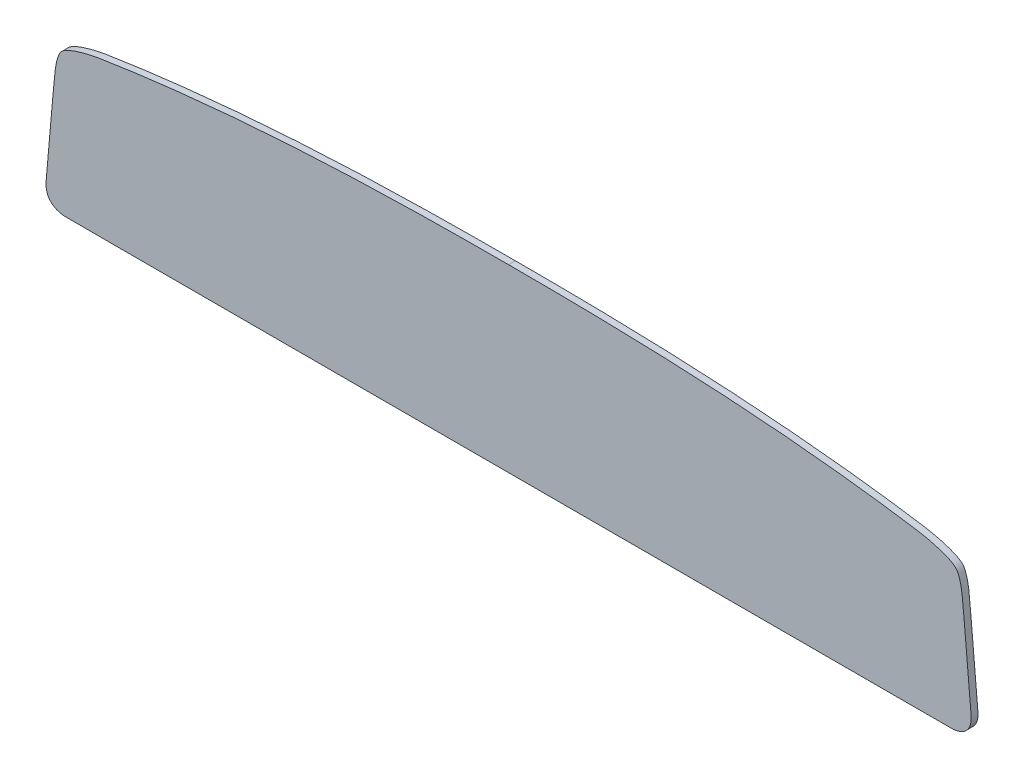
ISO-10303-21;
HEADER;
FILE_DESCRIPTION(('STEP AP214'),'2;1');
FILE_NAME('part.step','',(''),(''),'','','');
FILE_SCHEMA(('AUTOMOTIVE_DESIGN { 1 0 10303 214 1 1 1 1 }'));
ENDSEC;
DATA;
#1=APPLICATION_CONTEXT('core data for automotive mechanical design processes');
#2=APPLICATION_PROTOCOL_DEFINITION('international standard','automotive_design',2000,#1);
#3=PRODUCT_CONTEXT('',#1,'mechanical');
#4=PRODUCT('Part','Part','',(#3));
#5=PRODUCT_RELATED_PRODUCT_CATEGORY('part','',(#4));
#6=PRODUCT_DEFINITION_FORMATION('','',#4);
#7=PRODUCT_DEFINITION_CONTEXT('part definition',#1,'design');
#8=PRODUCT_DEFINITION('design','',#6,#7);
#9=PRODUCT_DEFINITION_SHAPE('','',#8);
#10=(LENGTH_UNIT() NAMED_UNIT(*) SI_UNIT(.MILLI.,.METRE.));
#11=(NAMED_UNIT(*) PLANE_ANGLE_UNIT() SI_UNIT($,.RADIAN.));
#12=(NAMED_UNIT(*) SI_UNIT($,.STERADIAN.) SOLID_ANGLE_UNIT());
#13=UNCERTAINTY_MEASURE_WITH_UNIT(LENGTH_MEASURE(1.E-05),#10,'distance_accuracy_value','');
#14=(GEOMETRIC_REPRESENTATION_CONTEXT(3) GLOBAL_UNCERTAINTY_ASSIGNED_CONTEXT((#13)) GLOBAL_UNIT_ASSIGNED_CONTEXT((#10,
#11,#12)) REPRESENTATION_CONTEXT('',''));
#15=CARTESIAN_POINT('',(0.,0.,0.));
#16=DIRECTION('',(0.,0.,1.));
#17=DIRECTION('',(1.,0.,0.));
#18=AXIS2_PLACEMENT_3D('',#15,#16,#17);
#19=CARTESIAN_POINT('',(0.,0.,10.3));
#20=DIRECTION('',(0.,0.,-1.));
#21=DIRECTION('',(-1.,0.,0.));
#22=AXIS2_PLACEMENT_3D('',#19,#20,#21);
#23=PLANE('',#22);
#24=CARTESIAN_POINT('',(-47.56912982624,0.326187795267278,10.3));
#25=CARTESIAN_POINT('',(-42.9675171023301,0.326187794812386,10.3));
#26=CARTESIAN_POINT('',(-36.0650978624594,0.3261879496746,10.3));
#27=CARTESIAN_POINT('',(-26.86187278429,0.3261875339793,10.3));
#28=CARTESIAN_POINT('',(-19.95945259593,0.3261887776534,10.3));
#29=CARTESIAN_POINT('',(-13.05703736517,0.3261841106344,10.3));
#30=CARTESIAN_POINT('',(-7.305010043133,0.3261986275571,10.3));
#31=CARTESIAN_POINT('',(-2.703419137806,0.3261690217879,10.3));
#32=CARTESIAN_POINT('',(0.1726374060877,0.3262443633776,10.3));
#33=CARTESIAN_POINT('',(2.473359002549,0.3260897128358,10.3));
#34=CARTESIAN_POINT('',(4.199135360457,0.3265621865685,10.3));
#35=CARTESIAN_POINT('',(5.636863057216,0.3250838962957,10.3));
#36=CARTESIAN_POINT('',(6.787248071171,0.3280996169696,10.3));
#37=CARTESIAN_POINT('',(7.463255217358,0.3209091780522,10.3));
#38=CARTESIAN_POINT('',(7.935416276697,0.3321241949565,10.3));
#39=CARTESIAN_POINT('',(8.212603998683,0.3633713733795,10.3));
#40=CARTESIAN_POINT('',(8.480052641929,0.4145581269059,10.3));
#41=CARTESIAN_POINT('',(8.729897320077,0.4857691221672,10.3));
#42=CARTESIAN_POINT('',(8.957801185256,0.5738717609444,10.3));
#43=CARTESIAN_POINT('',(9.224669903279,0.7072943620178,10.3));
#44=CARTESIAN_POINT('',(9.511257379615,0.906871851562,10.3));
#45=CARTESIAN_POINT('',(9.792086577824,1.204703354788,10.3));
#46=CARTESIAN_POINT('',(10.00836818754,1.559738126784,10.3));
#47=CARTESIAN_POINT('',(10.13182534579,1.905481822193,10.3));
#48=CARTESIAN_POINT('',(10.1951387356,2.210820467913,10.3));
#49=CARTESIAN_POINT('',(10.22309993046,2.459009113422,10.3));
#50=CARTESIAN_POINT('',(10.23107979456,2.713348619511,10.3));
#51=CARTESIAN_POINT('',(10.20742265749,3.098072775931,10.3));
#52=CARTESIAN_POINT('',(10.15596601473,3.621499994136,10.3));
#53=CARTESIAN_POINT('',(10.08249767637,4.487595546331,10.3));
#54=CARTESIAN_POINT('',(9.986751761239,5.56898525624,10.3));
#55=CARTESIAN_POINT('',(9.873532141202,6.867543757359,10.3));
#56=CARTESIAN_POINT('',(9.72182230868,8.598628142754,10.3));
#57=CARTESIAN_POINT('',(9.533681804831,10.76204756605,10.3));
#58=CARTESIAN_POINT('',(9.318242371288,13.17702275878,10.3));
#59=CARTESIAN_POINT('',(9.147275044242,15.26271276746,10.3));
#60=CARTESIAN_POINT('',(8.913444416757,16.66497356985,10.3));
#61=CARTESIAN_POINT('',(8.622934671494,17.47437248034,10.3));
#62=CARTESIAN_POINT('',(8.425301401111,17.84077184074,10.3));
#63=CARTESIAN_POINT('',(8.153699328102,18.10191669933,10.3));
#64=CARTESIAN_POINT('',(7.568204093403,18.49251158866,10.3));
#65=CARTESIAN_POINT('',(6.517945120839,18.89642972097,10.3));
#66=CARTESIAN_POINT('',(5.089092954338,19.30326698634,10.3));
#67=CARTESIAN_POINT('',(3.546154795837,19.61225958704,10.3));
#68=CARTESIAN_POINT('',(2.015957887505,19.84329222974,10.3));
#69=CARTESIAN_POINT('',(0.5532858331606,20.05314931454,10.3));
#70=CARTESIAN_POINT('',(-1.21518351073,20.2957101885,10.3));
#71=CARTESIAN_POINT('',(-2.909966123613,20.51413042768,10.3));
#72=CARTESIAN_POINT('',(-4.593822822222,20.71786882672,10.3));
#73=CARTESIAN_POINT('',(-5.919036057207,20.87126456612,10.3));
#74=CARTESIAN_POINT('',(-7.084558967214,20.99978161406,10.3));
#75=CARTESIAN_POINT('',(-8.084433697253,21.10574294895,10.3));
#76=CARTESIAN_POINT('',(-9.027071276399,21.20275617258,10.3));
#77=CARTESIAN_POINT('',(-10.19211410662,21.31807381719,10.3));
#78=CARTESIAN_POINT('',(-12.17220834892,21.50413701163,10.3));
#79=CARTESIAN_POINT('',(-14.90410813764,21.7375141162,10.3));
#80=CARTESIAN_POINT('',(-17.73956288004,21.94663775683,10.3));
#81=CARTESIAN_POINT('',(-20.047551304,22.09711386552,10.3));
#82=CARTESIAN_POINT('',(-21.71706705891,22.19693073835,10.3));
#83=CARTESIAN_POINT('',(-23.33812624813,22.28570521937,10.3));
#84=CARTESIAN_POINT('',(-25.46870124897,22.39223216237,10.3));
#85=CARTESIAN_POINT('',(-28.14695342634,22.50748327014,10.3));
#86=CARTESIAN_POINT('',(-31.38256714397,22.61812830096,10.3));
#87=CARTESIAN_POINT('',(-34.6148391263,22.70228395682,10.3));
#88=CARTESIAN_POINT('',(-37.84757844213,22.76302595806,10.3));
#89=CARTESIAN_POINT('',(-42.1577463893385,22.81643989411,10.3));
#90=CARTESIAN_POINT('',(-45.4026489557668,22.829299999934,10.3));
#91=CARTESIAN_POINT('',(-47.56912982624,22.8293000000036,10.3));
#92=(BOUNDED_CURVE() B_SPLINE_CURVE(3,(#24,#25,#26,#27,#28,#29,#30,#31,#32,#33,#34,#35,#36,#37,
#38,#39,#40,#41,#42,#43,#44,#45,#46,#47,#48,#49,#50,#51,#52,#53,#54,#55,#56,#57,#58,#59,#60,#61,
#62,#63,#64,#65,#66,#67,#68,#69,#70,#71,#72,#73,#74,#75,#76,#77,#78,#79,#80,#81,#82,#83,#84,#85,
#86,#87,#88,#89,#90,#91),.UNSPECIFIED.,.F.,.F.) B_SPLINE_CURVE_WITH_KNOTS((4,1,1,1,1,1,1,1,1,1,
1,1,1,1,1,1,1,1,1,1,1,1,1,1,1,1,1,1,1,1,1,1,1,1,1,1,1,1,1,1,1,1,1,1,1,1,1,1,1,1,1,1,1,1,1,1,1,1,
1,1,1,1,1,1,1,4),(0.009781740553698,0.11284573127,0.1643777267269,0.2159097221838,
0.2674417176408,0.3189737130977,0.3447397108261,0.3705057085546,0.3833887074188,0.3962717062831,
0.4091547051473,0.4155962045794,0.4220377040115,0.4242349708695,0.4263684734723,0.4284871168698,
0.4305066276168,0.4323886165174,0.4341630128674,0.4374707515101,0.4405314618342,0.4437562267761,
0.4471931906906,0.4490642840032,0.4510146761987,0.4529676655746,0.454974043667,0.4598390633293,
0.4647040829916,0.4744341223162,0.4841641616408,0.4938942009654,0.5133542796146,0.5328143582638,
0.5481564733989,0.5603087521199,0.5648438988546,0.5676572988122,0.5701671537192,0.5738569006531,
0.5837845928484,0.595526910136,0.607293228463,0.6191722019121,0.6302638946688,0.6403890641587,
0.659173068987,0.6685499972073,0.6783937372485,0.6890642469789,0.6948230020703,0.7009223223354,
0.7102963862294,0.7210540933888,0.7454826726341,0.7717267408706,0.7847530106776,0.7973016634395,
0.8091977513018,0.821125746063,0.845094456649,0.8692551555037,0.8936556548809,0.917529904039,
0.9416875997231,0.990217030628),
.UNSPECIFIED.) CURVE() GEOMETRIC_REPRESENTATION_ITEM() RATIONAL_B_SPLINE_CURVE((1.,1.,1.,1.,1.,
1.,1.,1.,1.,1.,1.,1.,1.,1.,1.,1.,1.,1.,1.,1.,1.,1.,1.,1.,1.,1.,1.,1.,1.,1.,1.,1.,1.,1.,1.,1.,1.,
1.,1.,1.,1.,1.,1.,1.,1.,1.,1.,1.,1.,1.,1.,1.,1.,1.,1.,1.,1.,1.,1.,1.,1.,1.,1.,1.,1.,1.,1.,1.)) REPRESENTATION_ITEM(''));
#93=CARTESIAN_POINT('',(-47.56912982624,0.326187795267278,10.2999999892631));
#94=VERTEX_POINT('',#93);
#95=CARTESIAN_POINT('',(-47.56912982624,22.8293000000036,10.3));
#96=VERTEX_POINT('',#95);
#97=EDGE_CURVE('E45',#94,#96,#92,.T.);
#98=ORIENTED_EDGE('',*,*,#97,.T.);
#99=CARTESIAN_POINT('',(-47.56912982624,0.326187795267278,10.3));
#100=CARTESIAN_POINT('',(-52.1707425501499,0.326187794812386,10.3));
#101=CARTESIAN_POINT('',(-59.0731617900206,0.3261879496746,10.3));
#102=CARTESIAN_POINT('',(-68.27638686819,0.3261875339793,10.3));
#103=CARTESIAN_POINT('',(-75.17880705655,0.3261887776534,10.3));
#104=CARTESIAN_POINT('',(-82.08122228731,0.3261841106344,10.3));
#105=CARTESIAN_POINT('',(-87.83324960935,0.3261986275571,10.3));
#106=CARTESIAN_POINT('',(-92.43484051468,0.3261690217879,10.3));
#107=CARTESIAN_POINT('',(-95.31089705857,0.3262443633776,10.3));
#108=CARTESIAN_POINT('',(-97.61161865503,0.3260897128358,10.3));
#109=CARTESIAN_POINT('',(-99.33739501294,0.3265621865685,10.3));
#110=CARTESIAN_POINT('',(-100.7751227097,0.3250838962957,10.3));
#111=CARTESIAN_POINT('',(-101.9255077237,0.3280996169696,10.3));
#112=CARTESIAN_POINT('',(-102.6015148698,0.3209091780522,10.3));
#113=CARTESIAN_POINT('',(-103.0736759292,0.3321241949565,10.3));
#114=CARTESIAN_POINT('',(-103.3508636512,0.3633713733795,10.3));
#115=CARTESIAN_POINT('',(-103.6183122944,0.4145581269059,10.3));
#116=CARTESIAN_POINT('',(-103.8681569726,0.4857691221672,10.3));
#117=CARTESIAN_POINT('',(-104.0960608377,0.5738717609444,10.3));
#118=CARTESIAN_POINT('',(-104.3629295558,0.7072943620178,10.3));
#119=CARTESIAN_POINT('',(-104.6495170321,0.906871851562,10.3));
#120=CARTESIAN_POINT('',(-104.9303462303,1.204703354788,10.3));
#121=CARTESIAN_POINT('',(-105.14662784,1.559738126784,10.3));
#122=CARTESIAN_POINT('',(-105.2700849983,1.905481822193,10.3));
#123=CARTESIAN_POINT('',(-105.3333983881,2.210820467913,10.3));
#124=CARTESIAN_POINT('',(-105.3613595829,2.459009113422,10.3));
#125=CARTESIAN_POINT('',(-105.369339447,2.713348619511,10.3));
#126=CARTESIAN_POINT('',(-105.34568231,3.098072775931,10.3));
#127=CARTESIAN_POINT('',(-105.2942256672,3.621499994136,10.3));
#128=CARTESIAN_POINT('',(-105.2207573289,4.487595546331,10.3));
#129=CARTESIAN_POINT('',(-105.1250114137,5.56898525624,10.3));
#130=CARTESIAN_POINT('',(-105.0117917937,6.867543757359,10.3));
#131=CARTESIAN_POINT('',(-104.8600819612,8.598628142754,10.3));
#132=CARTESIAN_POINT('',(-104.6719414573,10.76204756605,10.3));
#133=CARTESIAN_POINT('',(-104.4565020238,13.17702275878,10.3));
#134=CARTESIAN_POINT('',(-104.2855346967,15.26271276746,10.3));
#135=CARTESIAN_POINT('',(-104.0517040692,16.66497356985,10.3));
#136=CARTESIAN_POINT('',(-103.761194324,17.47437248034,10.3));
#137=CARTESIAN_POINT('',(-103.5635610536,17.84077184074,10.3));
#138=CARTESIAN_POINT('',(-103.2919589806,18.10191669933,10.3));
#139=CARTESIAN_POINT('',(-102.7064637459,18.49251158866,10.3));
#140=CARTESIAN_POINT('',(-101.6562047733,18.89642972097,10.3));
#141=CARTESIAN_POINT('',(-100.2273526068,19.30326698634,10.3));
#142=CARTESIAN_POINT('',(-98.68441444832,19.61225958704,10.3));
#143=CARTESIAN_POINT('',(-97.15421753999,19.84329222974,10.3));
#144=CARTESIAN_POINT('',(-95.69154548564,20.05314931454,10.3));
#145=CARTESIAN_POINT('',(-93.92307614175,20.2957101885,10.3));
#146=CARTESIAN_POINT('',(-92.22829352887,20.51413042768,10.3));
#147=CARTESIAN_POINT('',(-90.54443683026,20.71786882672,10.3));
#148=CARTESIAN_POINT('',(-89.21922359528,20.87126456612,10.3));
#149=CARTESIAN_POINT('',(-88.05370068527,20.99978161406,10.3));
#150=CARTESIAN_POINT('',(-87.05382595523,21.10574294895,10.3));
#151=CARTESIAN_POINT('',(-86.11118837608,21.20275617258,10.3));
#152=CARTESIAN_POINT('',(-84.94614554587,21.31807381719,10.3));
#153=CARTESIAN_POINT('',(-82.96605130356,21.50413701163,10.3));
#154=CARTESIAN_POINT('',(-80.23415151485,21.7375141162,10.3));
#155=CARTESIAN_POINT('',(-77.39869677244,21.94663775683,10.3));
#156=CARTESIAN_POINT('',(-75.09070834848,22.09711386552,10.3));
#157=CARTESIAN_POINT('',(-73.42119259357,22.19693073835,10.3));
#158=CARTESIAN_POINT('',(-71.80013340435,22.28570521937,10.3));
#159=CARTESIAN_POINT('',(-69.66955840351,22.39223216237,10.3));
#160=CARTESIAN_POINT('',(-66.99130622614,22.50748327014,10.3));
#161=CARTESIAN_POINT('',(-63.75569250851,22.61812830096,10.3));
#162=CARTESIAN_POINT('',(-60.52342052618,22.70228395682,10.3));
#163=CARTESIAN_POINT('',(-57.29068121036,22.76302595806,10.3));
#164=CARTESIAN_POINT('',(-52.9805132631416,22.81643989411,10.3));
#165=CARTESIAN_POINT('',(-49.7356106967132,22.829299999934,10.3));
#166=CARTESIAN_POINT('',(-47.56912982624,22.8293000000036,10.3));
#167=(BOUNDED_CURVE() B_SPLINE_CURVE(3,(#99,#100,#101,#102,#103,#104,#105,#106,#107,#108,#109,
#110,#111,#112,#113,#114,#115,#116,#117,#118,#119,#120,#121,#122,#123,#124,#125,#126,#127,#128,
#129,#130,#131,#132,#133,#134,#135,#136,#137,#138,#139,#140,#141,#142,#143,#144,#145,#146,#147,
#148,#149,#150,#151,#152,#153,#154,#155,#156,#157,#158,#159,#160,#161,#162,#163,#164,#165,#166),
.UNSPECIFIED.,.F.,.F.) B_SPLINE_CURVE_WITH_KNOTS((4,1,1,1,1,1,1,1,1,1,1,1,1,1,1,1,1,1,1,1,1,1,1,
1,1,1,1,1,1,1,1,1,1,1,1,1,1,1,1,1,1,1,1,1,1,1,1,1,1,1,1,1,1,1,1,1,1,1,1,1,1,1,1,1,1,4),
(0.009781740553698,0.11284573127,0.1643777267269,0.2159097221838,0.2674417176408,
0.3189737130977,0.3447397108261,0.3705057085546,0.3833887074188,0.3962717062831,0.4091547051473,
0.4155962045794,0.4220377040115,0.4242349708695,0.4263684734723,0.4284871168698,0.4305066276168,
0.4323886165174,0.4341630128674,0.4374707515101,0.4405314618342,0.4437562267761,0.4471931906906,
0.4490642840032,0.4510146761987,0.4529676655746,0.454974043667,0.4598390633293,0.4647040829916,
0.4744341223162,0.4841641616408,0.4938942009654,0.5133542796146,0.5328143582638,0.5481564733989,
0.5603087521199,0.5648438988546,0.5676572988122,0.5701671537192,0.5738569006531,0.5837845928484,
0.595526910136,0.607293228463,0.6191722019121,0.6302638946688,0.6403890641587,0.659173068987,
0.6685499972073,0.6783937372485,0.6890642469789,0.6948230020703,0.7009223223354,0.7102963862294,
0.7210540933888,0.7454826726341,0.7717267408706,0.7847530106776,0.7973016634395,0.8091977513018,
0.821125746063,0.845094456649,0.8692551555037,0.8936556548809,0.917529904039,0.9416875997231,
0.990217030628),
.UNSPECIFIED.) CURVE() GEOMETRIC_REPRESENTATION_ITEM() RATIONAL_B_SPLINE_CURVE((1.,1.,1.,1.,1.,
1.,1.,1.,1.,1.,1.,1.,1.,1.,1.,1.,1.,1.,1.,1.,1.,1.,1.,1.,1.,1.,1.,1.,1.,1.,1.,1.,1.,1.,1.,1.,1.,
1.,1.,1.,1.,1.,1.,1.,1.,1.,1.,1.,1.,1.,1.,1.,1.,1.,1.,1.,1.,1.,1.,1.,1.,1.,1.,1.,1.,1.,1.,1.)) REPRESENTATION_ITEM(''));
#168=EDGE_CURVE('E20',#96,#94,#167,.F.);
#169=ORIENTED_EDGE('',*,*,#168,.T.);
#170=EDGE_LOOP('',(#98,#169));
#171=FACE_BOUND('',#170,.T.);
#172=ADVANCED_FACE('F17',(#171),#23,.F.);
#173=CARTESIAN_POINT('',(-46.25892105071,0.326187798465,9.45));
#174=CARTESIAN_POINT('',(-46.69565730815,0.3261877962877,9.45));
#175=CARTESIAN_POINT('',(-51.73400628119,0.3261877850138,9.45));
#176=CARTESIAN_POINT('',(-59.07316179002,0.3261879496746,9.45));
#177=CARTESIAN_POINT('',(-68.27638686819,0.3261875339793,9.45));
#178=CARTESIAN_POINT('',(-75.17880705655,0.3261887776534,9.45));
#179=CARTESIAN_POINT('',(-82.08122228731,0.3261841106344,9.45));
#180=CARTESIAN_POINT('',(-87.83324960935,0.3261986275571,9.45));
#181=CARTESIAN_POINT('',(-92.43484051468,0.3261690217879,9.45));
#182=CARTESIAN_POINT('',(-95.31089705857,0.3262443633776,9.45));
#183=CARTESIAN_POINT('',(-97.61161865503,0.3260897128358,9.45));
#184=CARTESIAN_POINT('',(-99.33739501294,0.3265621865685,9.45));
#185=CARTESIAN_POINT('',(-100.7751227097,0.3250838962957,9.45));
#186=CARTESIAN_POINT('',(-101.9255077237,0.3280996169696,9.45));
#187=CARTESIAN_POINT('',(-102.6015148698,0.3209091780522,9.45));
#188=CARTESIAN_POINT('',(-103.0736759292,0.3321241949565,9.45));
#189=CARTESIAN_POINT('',(-103.3508636512,0.3633713733795,9.45));
#190=CARTESIAN_POINT('',(-103.6183122944,0.4145581269059,9.45));
#191=CARTESIAN_POINT('',(-103.8681569726,0.4857691221672,9.45));
#192=CARTESIAN_POINT('',(-104.0960608377,0.5738717609444,9.45));
#193=CARTESIAN_POINT('',(-104.3629295558,0.7072943620178,9.45));
#194=CARTESIAN_POINT('',(-104.6495170321,0.906871851562,9.45));
#195=CARTESIAN_POINT('',(-104.9303462303,1.204703354788,9.45));
#196=CARTESIAN_POINT('',(-105.14662784,1.559738126784,9.45));
#197=CARTESIAN_POINT('',(-105.2700849983,1.905481822193,9.45));
#198=CARTESIAN_POINT('',(-105.3333983881,2.210820467913,9.45));
#199=CARTESIAN_POINT('',(-105.3613595829,2.459009113422,9.45));
#200=CARTESIAN_POINT('',(-105.369339447,2.713348619511,9.45));
#201=CARTESIAN_POINT('',(-105.34568231,3.098072775931,9.45));
#202=CARTESIAN_POINT('',(-105.2942256672,3.621499994136,9.45));
#203=CARTESIAN_POINT('',(-105.2207573289,4.487595546331,9.45));
#204=CARTESIAN_POINT('',(-105.1250114137,5.56898525624,9.45));
#205=CARTESIAN_POINT('',(-105.0117917937,6.867543757359,9.45));
#206=CARTESIAN_POINT('',(-104.8600819612,8.598628142754,9.45));
#207=CARTESIAN_POINT('',(-104.6719414573,10.76204756605,9.45));
#208=CARTESIAN_POINT('',(-104.4565020238,13.17702275878,9.45));
#209=CARTESIAN_POINT('',(-104.2855346967,15.26271276746,9.45));
#210=CARTESIAN_POINT('',(-104.0517040692,16.66497356985,9.45));
#211=CARTESIAN_POINT('',(-103.761194324,17.47437248034,9.45));
#212=CARTESIAN_POINT('',(-103.5635610536,17.84077184074,9.45));
#213=CARTESIAN_POINT('',(-103.2919589806,18.10191669933,9.45));
#214=CARTESIAN_POINT('',(-102.7064637459,18.49251158866,9.45));
#215=CARTESIAN_POINT('',(-101.6562047733,18.89642972097,9.45));
#216=CARTESIAN_POINT('',(-100.2273526068,19.30326698634,9.45));
#217=CARTESIAN_POINT('',(-98.68441444832,19.61225958704,9.45));
#218=CARTESIAN_POINT('',(-97.15421753999,19.84329222974,9.45));
#219=CARTESIAN_POINT('',(-95.69154548564,20.05314931454,9.45));
#220=CARTESIAN_POINT('',(-93.92307614175,20.2957101885,9.45));
#221=CARTESIAN_POINT('',(-92.22829352887,20.51413042768,9.45));
#222=CARTESIAN_POINT('',(-90.54443683026,20.71786882672,9.45));
#223=CARTESIAN_POINT('',(-89.21922359528,20.87126456612,9.45));
#224=CARTESIAN_POINT('',(-88.05370068527,20.99978161406,9.45));
#225=CARTESIAN_POINT('',(-87.05382595523,21.10574294895,9.45));
#226=CARTESIAN_POINT('',(-86.11118837608,21.20275617258,9.45));
#227=CARTESIAN_POINT('',(-84.94614554587,21.31807381719,9.45));
#228=CARTESIAN_POINT('',(-82.96605130356,21.50413701163,9.45));
#229=CARTESIAN_POINT('',(-80.23415151485,21.7375141162,9.45));
#230=CARTESIAN_POINT('',(-77.39869677244,21.94663775683,9.45));
#231=CARTESIAN_POINT('',(-75.09070834848,22.09711386552,9.45));
#232=CARTESIAN_POINT('',(-73.42119259357,22.19693073835,9.45));
#233=CARTESIAN_POINT('',(-71.80013340435,22.28570521937,9.45));
#234=CARTESIAN_POINT('',(-69.66955840351,22.39223216237,9.45));
#235=CARTESIAN_POINT('',(-66.99130622614,22.50748327014,9.45));
#236=CARTESIAN_POINT('',(-63.75569250851,22.61812830096,9.45));
#237=CARTESIAN_POINT('',(-60.52342052618,22.70228395682,9.45));
#238=CARTESIAN_POINT('',(-57.29068121036,22.76302595806,9.45));
#239=CARTESIAN_POINT('',(-52.98051326314,22.81643989411,9.45));
#240=CARTESIAN_POINT('',(-49.29887885832,22.83103084317,9.45));
#241=CARTESIAN_POINT('',(-46.69565397204,22.82895108215,9.45));
#242=CARTESIAN_POINT('',(-46.25891560483,22.82828277288,9.45));
#243=(BOUNDED_CURVE() B_SPLINE_CURVE(3,(#173,#174,#175,#176,#177,#178,#179,#180,#181,#182,#183,
#184,#185,#186,#187,#188,#189,#190,#191,#192,#193,#194,#195,#196,#197,#198,#199,#200,#201,#202,
#203,#204,#205,#206,#207,#208,#209,#210,#211,#212,#213,#214,#215,#216,#217,#218,#219,#220,#221,
#222,#223,#224,#225,#226,#227,#228,#229,#230,#231,#232,#233,#234,#235,#236,#237,#238,#239,#240,
#241,#242),.UNSPECIFIED.,.F.,.F.) B_SPLINE_CURVE_WITH_KNOTS((4,1,1,1,1,1,1,1,1,1,1,1,1,1,1,1,1,
1,1,1,1,1,1,1,1,1,1,1,1,1,1,1,1,1,1,1,1,1,1,1,1,1,1,1,1,1,1,1,1,1,1,1,1,1,1,1,1,1,1,1,1,1,1,1,1,
1,1,4),(0.,0.009781740553698,0.11284573127,0.1643777267269,0.2159097221838,0.2674417176408,
0.3189737130977,0.3447397108261,0.3705057085546,0.3833887074188,0.3962717062831,0.4091547051473,
0.4155962045794,0.4220377040115,0.4242349708695,0.4263684734723,0.4284871168698,0.4305066276168,
0.4323886165174,0.4341630128674,0.4374707515101,0.4405314618342,0.4437562267761,0.4471931906906,
0.4490642840032,0.4510146761987,0.4529676655746,0.454974043667,0.4598390633293,0.4647040829916,
0.4744341223162,0.4841641616408,0.4938942009654,0.5133542796146,0.5328143582638,0.5481564733989,
0.5603087521199,0.5648438988546,0.5676572988122,0.5701671537192,0.5738569006531,0.5837845928484,
0.595526910136,0.607293228463,0.6191722019121,0.6302638946688,0.6403890641587,0.659173068987,
0.6685499972073,0.6783937372485,0.6890642469789,0.6948230020703,0.7009223223354,0.7102963862294,
0.7210540933888,0.7454826726341,0.7717267408706,0.7847530106776,0.7973016634395,0.8091977513018,
0.821125746063,0.845094456649,0.8692551555037,0.8936556548809,0.917529904039,0.9416875997231,
0.990217030628,1.),
.UNSPECIFIED.) CURVE() GEOMETRIC_REPRESENTATION_ITEM() RATIONAL_B_SPLINE_CURVE((1.,1.,1.,1.,1.,
1.,1.,1.,1.,1.,1.,1.,1.,1.,1.,1.,1.,1.,1.,1.,1.,1.,1.,1.,1.,1.,1.,1.,1.,1.,1.,1.,1.,1.,1.,1.,1.,
1.,1.,1.,1.,1.,1.,1.,1.,1.,1.,1.,1.,1.,1.,1.,1.,1.,1.,1.,1.,1.,1.,1.,1.,1.,1.,1.,1.,1.,1.,1.,1.,1.)) REPRESENTATION_ITEM(''));
#244=DIRECTION('',(0.,0.,1.));
#245=VECTOR('',#244,1.);
#246=SURFACE_OF_LINEAR_EXTRUSION('',#243,#245);
#247=DIRECTION('',(0.,0.,-1.));
#248=VECTOR('',#247,1.);
#249=CARTESIAN_POINT('',(-47.56912982624,22.8293000000036,9.45));
#250=LINE('',#249,#248);
#251=CARTESIAN_POINT('',(-47.56912982624,22.8293000000036,9.4500000096994));
#252=VERTEX_POINT('',#251);
#253=EDGE_CURVE('E37',#96,#252,#250,.T.);
#254=ORIENTED_EDGE('',*,*,#253,.T.);
#255=CARTESIAN_POINT('',(-47.56912982624,0.326187795267278,9.45));
#256=CARTESIAN_POINT('',(-52.1707425501499,0.326187794812386,9.45));
#257=CARTESIAN_POINT('',(-59.0731617900206,0.3261879496746,9.45));
#258=CARTESIAN_POINT('',(-68.27638686819,0.3261875339793,9.45));
#259=CARTESIAN_POINT('',(-75.17880705655,0.3261887776534,9.45));
#260=CARTESIAN_POINT('',(-82.08122228731,0.3261841106344,9.45));
#261=CARTESIAN_POINT('',(-87.83324960935,0.3261986275571,9.45));
#262=CARTESIAN_POINT('',(-92.43484051468,0.3261690217879,9.45));
#263=CARTESIAN_POINT('',(-95.31089705857,0.3262443633776,9.45));
#264=CARTESIAN_POINT('',(-97.61161865503,0.3260897128358,9.45));
#265=CARTESIAN_POINT('',(-99.33739501294,0.3265621865685,9.45));
#266=CARTESIAN_POINT('',(-100.7751227097,0.3250838962957,9.45));
#267=CARTESIAN_POINT('',(-101.9255077237,0.3280996169696,9.45));
#268=CARTESIAN_POINT('',(-102.6015148698,0.3209091780522,9.45));
#269=CARTESIAN_POINT('',(-103.0736759292,0.3321241949565,9.45));
#270=CARTESIAN_POINT('',(-103.3508636512,0.3633713733795,9.45));
#271=CARTESIAN_POINT('',(-103.6183122944,0.4145581269059,9.45));
#272=CARTESIAN_POINT('',(-103.8681569726,0.4857691221672,9.45));
#273=CARTESIAN_POINT('',(-104.0960608377,0.5738717609444,9.45));
#274=CARTESIAN_POINT('',(-104.3629295558,0.7072943620178,9.45));
#275=CARTESIAN_POINT('',(-104.6495170321,0.906871851562,9.45));
#276=CARTESIAN_POINT('',(-104.9303462303,1.204703354788,9.45));
#277=CARTESIAN_POINT('',(-105.14662784,1.559738126784,9.45));
#278=CARTESIAN_POINT('',(-105.2700849983,1.905481822193,9.45));
#279=CARTESIAN_POINT('',(-105.3333983881,2.210820467913,9.45));
#280=CARTESIAN_POINT('',(-105.3613595829,2.459009113422,9.45));
#281=CARTESIAN_POINT('',(-105.369339447,2.713348619511,9.45));
#282=CARTESIAN_POINT('',(-105.34568231,3.098072775931,9.45));
#283=CARTESIAN_POINT('',(-105.2942256672,3.621499994136,9.45));
#284=CARTESIAN_POINT('',(-105.2207573289,4.487595546331,9.45));
#285=CARTESIAN_POINT('',(-105.1250114137,5.56898525624,9.45));
#286=CARTESIAN_POINT('',(-105.0117917937,6.867543757359,9.45));
#287=CARTESIAN_POINT('',(-104.8600819612,8.598628142754,9.45));
#288=CARTESIAN_POINT('',(-104.6719414573,10.76204756605,9.45));
#289=CARTESIAN_POINT('',(-104.4565020238,13.17702275878,9.45));
#290=CARTESIAN_POINT('',(-104.2855346967,15.26271276746,9.45));
#291=CARTESIAN_POINT('',(-104.0517040692,16.66497356985,9.45));
#292=CARTESIAN_POINT('',(-103.761194324,17.47437248034,9.45));
#293=CARTESIAN_POINT('',(-103.5635610536,17.84077184074,9.45));
#294=CARTESIAN_POINT('',(-103.2919589806,18.10191669933,9.45));
#295=CARTESIAN_POINT('',(-102.7064637459,18.49251158866,9.45));
#296=CARTESIAN_POINT('',(-101.6562047733,18.89642972097,9.45));
#297=CARTESIAN_POINT('',(-100.2273526068,19.30326698634,9.45));
#298=CARTESIAN_POINT('',(-98.68441444832,19.61225958704,9.45));
#299=CARTESIAN_POINT('',(-97.15421753999,19.84329222974,9.45));
#300=CARTESIAN_POINT('',(-95.69154548564,20.05314931454,9.45));
#301=CARTESIAN_POINT('',(-93.92307614175,20.2957101885,9.45));
#302=CARTESIAN_POINT('',(-92.22829352887,20.51413042768,9.45));
#303=CARTESIAN_POINT('',(-90.54443683026,20.71786882672,9.45));
#304=CARTESIAN_POINT('',(-89.21922359528,20.87126456612,9.45));
#305=CARTESIAN_POINT('',(-88.05370068527,20.99978161406,9.45));
#306=CARTESIAN_POINT('',(-87.05382595523,21.10574294895,9.45));
#307=CARTESIAN_POINT('',(-86.11118837608,21.20275617258,9.45));
#308=CARTESIAN_POINT('',(-84.94614554587,21.31807381719,9.45));
#309=CARTESIAN_POINT('',(-82.96605130356,21.50413701163,9.45));
#310=CARTESIAN_POINT('',(-80.23415151485,21.7375141162,9.45));
#311=CARTESIAN_POINT('',(-77.39869677244,21.94663775683,9.45));
#312=CARTESIAN_POINT('',(-75.09070834848,22.09711386552,9.45));
#313=CARTESIAN_POINT('',(-73.42119259357,22.19693073835,9.45));
#314=CARTESIAN_POINT('',(-71.80013340435,22.28570521937,9.45));
#315=CARTESIAN_POINT('',(-69.66955840351,22.39223216237,9.45));
#316=CARTESIAN_POINT('',(-66.99130622614,22.50748327014,9.45));
#317=CARTESIAN_POINT('',(-63.75569250851,22.61812830096,9.45));
#318=CARTESIAN_POINT('',(-60.52342052618,22.70228395682,9.45));
#319=CARTESIAN_POINT('',(-57.29068121036,22.76302595806,9.45));
#320=CARTESIAN_POINT('',(-52.9805132631416,22.81643989411,9.45));
#321=CARTESIAN_POINT('',(-49.7356106967132,22.829299999934,9.45));
#322=CARTESIAN_POINT('',(-47.56912982624,22.8293000000036,9.45));
#323=(BOUNDED_CURVE() B_SPLINE_CURVE(3,(#255,#256,#257,#258,#259,#260,#261,#262,#263,#264,#265,
#266,#267,#268,#269,#270,#271,#272,#273,#274,#275,#276,#277,#278,#279,#280,#281,#282,#283,#284,
#285,#286,#287,#288,#289,#290,#291,#292,#293,#294,#295,#296,#297,#298,#299,#300,#301,#302,#303,
#304,#305,#306,#307,#308,#309,#310,#311,#312,#313,#314,#315,#316,#317,#318,#319,#320,#321,#322),
.UNSPECIFIED.,.F.,.F.) B_SPLINE_CURVE_WITH_KNOTS((4,1,1,1,1,1,1,1,1,1,1,1,1,1,1,1,1,1,1,1,1,1,1,
1,1,1,1,1,1,1,1,1,1,1,1,1,1,1,1,1,1,1,1,1,1,1,1,1,1,1,1,1,1,1,1,1,1,1,1,1,1,1,1,1,1,4),
(0.009781740553698,0.11284573127,0.1643777267269,0.2159097221838,0.2674417176408,
0.3189737130977,0.3447397108261,0.3705057085546,0.3833887074188,0.3962717062831,0.4091547051473,
0.4155962045794,0.4220377040115,0.4242349708695,0.4263684734723,0.4284871168698,0.4305066276168,
0.4323886165174,0.4341630128674,0.4374707515101,0.4405314618342,0.4437562267761,0.4471931906906,
0.4490642840032,0.4510146761987,0.4529676655746,0.454974043667,0.4598390633293,0.4647040829916,
0.4744341223162,0.4841641616408,0.4938942009654,0.5133542796146,0.5328143582638,0.5481564733989,
0.5603087521199,0.5648438988546,0.5676572988122,0.5701671537192,0.5738569006531,0.5837845928484,
0.595526910136,0.607293228463,0.6191722019121,0.6302638946688,0.6403890641587,0.659173068987,
0.6685499972073,0.6783937372485,0.6890642469789,0.6948230020703,0.7009223223354,0.7102963862294,
0.7210540933888,0.7454826726341,0.7717267408706,0.7847530106776,0.7973016634395,0.8091977513018,
0.821125746063,0.845094456649,0.8692551555037,0.8936556548809,0.917529904039,0.9416875997231,
0.990217030628),
.UNSPECIFIED.) CURVE() GEOMETRIC_REPRESENTATION_ITEM() RATIONAL_B_SPLINE_CURVE((1.,1.,1.,1.,1.,
1.,1.,1.,1.,1.,1.,1.,1.,1.,1.,1.,1.,1.,1.,1.,1.,1.,1.,1.,1.,1.,1.,1.,1.,1.,1.,1.,1.,1.,1.,1.,1.,
1.,1.,1.,1.,1.,1.,1.,1.,1.,1.,1.,1.,1.,1.,1.,1.,1.,1.,1.,1.,1.,1.,1.,1.,1.,1.,1.,1.,1.,1.,1.)) REPRESENTATION_ITEM(''));
#324=CARTESIAN_POINT('',(-47.56912982624,0.326187795267278,9.45));
#325=VERTEX_POINT('',#324);
#326=EDGE_CURVE('E28',#325,#252,#323,.T.);
#327=ORIENTED_EDGE('',*,*,#326,.F.);
#328=DIRECTION('',(0.,0.,-1.));
#329=VECTOR('',#328,1.);
#330=CARTESIAN_POINT('',(-47.56912982624,0.326187795267278,9.45));
#331=LINE('',#330,#329);
#332=EDGE_CURVE('E47',#325,#94,#331,.F.);
#333=ORIENTED_EDGE('',*,*,#332,.T.);
#334=ORIENTED_EDGE('',*,*,#168,.F.);
#335=EDGE_LOOP('',(#254,#327,#333,#334));
#336=FACE_BOUND('',#335,.T.);
#337=ADVANCED_FACE('F49',(#336),#246,.F.);
#338=CARTESIAN_POINT('',(-48.87933860177,0.326187798465,9.45));
#339=CARTESIAN_POINT('',(-48.44260234433,0.3261877962877,9.45));
#340=CARTESIAN_POINT('',(-43.40425337129,0.3261877850138,9.45));
#341=CARTESIAN_POINT('',(-36.06509786246,0.3261879496746,9.45));
#342=CARTESIAN_POINT('',(-26.86187278429,0.3261875339793,9.45));
#343=CARTESIAN_POINT('',(-19.95945259593,0.3261887776534,9.45));
#344=CARTESIAN_POINT('',(-13.05703736517,0.3261841106344,9.45));
#345=CARTESIAN_POINT('',(-7.305010043133,0.3261986275571,9.45));
#346=CARTESIAN_POINT('',(-2.703419137806,0.3261690217879,9.45));
#347=CARTESIAN_POINT('',(0.1726374060877,0.3262443633776,9.45));
#348=CARTESIAN_POINT('',(2.473359002549,0.3260897128358,9.45));
#349=CARTESIAN_POINT('',(4.199135360457,0.3265621865685,9.45));
#350=CARTESIAN_POINT('',(5.636863057216,0.3250838962957,9.45));
#351=CARTESIAN_POINT('',(6.787248071171,0.3280996169696,9.45));
#352=CARTESIAN_POINT('',(7.463255217358,0.3209091780522,9.45));
#353=CARTESIAN_POINT('',(7.935416276697,0.3321241949565,9.45));
#354=CARTESIAN_POINT('',(8.212603998683,0.3633713733795,9.45));
#355=CARTESIAN_POINT('',(8.480052641929,0.4145581269059,9.45));
#356=CARTESIAN_POINT('',(8.729897320077,0.4857691221672,9.45));
#357=CARTESIAN_POINT('',(8.957801185256,0.5738717609444,9.45));
#358=CARTESIAN_POINT('',(9.224669903279,0.7072943620178,9.45));
#359=CARTESIAN_POINT('',(9.511257379615,0.906871851562,9.45));
#360=CARTESIAN_POINT('',(9.792086577824,1.204703354788,9.45));
#361=CARTESIAN_POINT('',(10.00836818754,1.559738126784,9.45));
#362=CARTESIAN_POINT('',(10.13182534579,1.905481822193,9.45));
#363=CARTESIAN_POINT('',(10.1951387356,2.210820467913,9.45));
#364=CARTESIAN_POINT('',(10.22309993046,2.459009113422,9.45));
#365=CARTESIAN_POINT('',(10.23107979456,2.713348619511,9.45));
#366=CARTESIAN_POINT('',(10.20742265749,3.098072775931,9.45));
#367=CARTESIAN_POINT('',(10.15596601473,3.621499994136,9.45));
#368=CARTESIAN_POINT('',(10.08249767637,4.487595546331,9.45));
#369=CARTESIAN_POINT('',(9.986751761239,5.56898525624,9.45));
#370=CARTESIAN_POINT('',(9.873532141202,6.867543757359,9.45));
#371=CARTESIAN_POINT('',(9.72182230868,8.598628142754,9.45));
#372=CARTESIAN_POINT('',(9.533681804831,10.76204756605,9.45));
#373=CARTESIAN_POINT('',(9.318242371288,13.17702275878,9.45));
#374=CARTESIAN_POINT('',(9.147275044242,15.26271276746,9.45));
#375=CARTESIAN_POINT('',(8.913444416757,16.66497356985,9.45));
#376=CARTESIAN_POINT('',(8.622934671494,17.47437248034,9.45));
#377=CARTESIAN_POINT('',(8.425301401111,17.84077184074,9.45));
#378=CARTESIAN_POINT('',(8.153699328102,18.10191669933,9.45));
#379=CARTESIAN_POINT('',(7.568204093403,18.49251158866,9.45));
#380=CARTESIAN_POINT('',(6.517945120839,18.89642972097,9.45));
#381=CARTESIAN_POINT('',(5.089092954338,19.30326698634,9.45));
#382=CARTESIAN_POINT('',(3.546154795837,19.61225958704,9.45));
#383=CARTESIAN_POINT('',(2.015957887505,19.84329222974,9.45));
#384=CARTESIAN_POINT('',(0.5532858331606,20.05314931454,9.45));
#385=CARTESIAN_POINT('',(-1.21518351073,20.2957101885,9.45));
#386=CARTESIAN_POINT('',(-2.909966123613,20.51413042768,9.45));
#387=CARTESIAN_POINT('',(-4.593822822222,20.71786882672,9.45));
#388=CARTESIAN_POINT('',(-5.919036057207,20.87126456612,9.45));
#389=CARTESIAN_POINT('',(-7.084558967214,20.99978161406,9.45));
#390=CARTESIAN_POINT('',(-8.084433697253,21.10574294895,9.45));
#391=CARTESIAN_POINT('',(-9.027071276399,21.20275617258,9.45));
#392=CARTESIAN_POINT('',(-10.19211410662,21.31807381719,9.45));
#393=CARTESIAN_POINT('',(-12.17220834892,21.50413701163,9.45));
#394=CARTESIAN_POINT('',(-14.90410813764,21.7375141162,9.45));
#395=CARTESIAN_POINT('',(-17.73956288004,21.94663775683,9.45));
#396=CARTESIAN_POINT('',(-20.047551304,22.09711386552,9.45));
#397=CARTESIAN_POINT('',(-21.71706705891,22.19693073835,9.45));
#398=CARTESIAN_POINT('',(-23.33812624813,22.28570521937,9.45));
#399=CARTESIAN_POINT('',(-25.46870124897,22.39223216237,9.45));
#400=CARTESIAN_POINT('',(-28.14695342634,22.50748327014,9.45));
#401=CARTESIAN_POINT('',(-31.38256714397,22.61812830096,9.45));
#402=CARTESIAN_POINT('',(-34.6148391263,22.70228395682,9.45));
#403=CARTESIAN_POINT('',(-37.84757844213,22.76302595806,9.45));
#404=CARTESIAN_POINT('',(-42.15774638934,22.81643989411,9.45));
#405=CARTESIAN_POINT('',(-45.83938079416,22.83103084317,9.45));
#406=CARTESIAN_POINT('',(-48.44260568044,22.82895108215,9.45));
#407=CARTESIAN_POINT('',(-48.87934404765,22.82828277288,9.45));
#408=(BOUNDED_CURVE() B_SPLINE_CURVE(3,(#338,#339,#340,#341,#342,#343,#344,#345,#346,#347,#348,
#349,#350,#351,#352,#353,#354,#355,#356,#357,#358,#359,#360,#361,#362,#363,#364,#365,#366,#367,
#368,#369,#370,#371,#372,#373,#374,#375,#376,#377,#378,#379,#380,#381,#382,#383,#384,#385,#386,
#387,#388,#389,#390,#391,#392,#393,#394,#395,#396,#397,#398,#399,#400,#401,#402,#403,#404,#405,
#406,#407),.UNSPECIFIED.,.F.,.F.) B_SPLINE_CURVE_WITH_KNOTS((4,1,1,1,1,1,1,1,1,1,1,1,1,1,1,1,1,
1,1,1,1,1,1,1,1,1,1,1,1,1,1,1,1,1,1,1,1,1,1,1,1,1,1,1,1,1,1,1,1,1,1,1,1,1,1,1,1,1,1,1,1,1,1,1,1,
1,1,4),(0.,0.009781740553698,0.11284573127,0.1643777267269,0.2159097221838,0.2674417176408,
0.3189737130977,0.3447397108261,0.3705057085546,0.3833887074188,0.3962717062831,0.4091547051473,
0.4155962045794,0.4220377040115,0.4242349708695,0.4263684734723,0.4284871168698,0.4305066276168,
0.4323886165174,0.4341630128674,0.4374707515101,0.4405314618342,0.4437562267761,0.4471931906906,
0.4490642840032,0.4510146761987,0.4529676655746,0.454974043667,0.4598390633293,0.4647040829916,
0.4744341223162,0.4841641616408,0.4938942009654,0.5133542796146,0.5328143582638,0.5481564733989,
0.5603087521199,0.5648438988546,0.5676572988122,0.5701671537192,0.5738569006531,0.5837845928484,
0.595526910136,0.607293228463,0.6191722019121,0.6302638946688,0.6403890641587,0.659173068987,
0.6685499972073,0.6783937372485,0.6890642469789,0.6948230020703,0.7009223223354,0.7102963862294,
0.7210540933888,0.7454826726341,0.7717267408706,0.7847530106776,0.7973016634395,0.8091977513018,
0.821125746063,0.845094456649,0.8692551555037,0.8936556548809,0.917529904039,0.9416875997231,
0.990217030628,1.),
.UNSPECIFIED.) CURVE() GEOMETRIC_REPRESENTATION_ITEM() RATIONAL_B_SPLINE_CURVE((1.,1.,1.,1.,1.,
1.,1.,1.,1.,1.,1.,1.,1.,1.,1.,1.,1.,1.,1.,1.,1.,1.,1.,1.,1.,1.,1.,1.,1.,1.,1.,1.,1.,1.,1.,1.,1.,
1.,1.,1.,1.,1.,1.,1.,1.,1.,1.,1.,1.,1.,1.,1.,1.,1.,1.,1.,1.,1.,1.,1.,1.,1.,1.,1.,1.,1.,1.,1.,1.,1.)) REPRESENTATION_ITEM(''));
#409=DIRECTION('',(0.,0.,-1.));
#410=VECTOR('',#409,1.);
#411=SURFACE_OF_LINEAR_EXTRUSION('',#408,#410);
#412=ORIENTED_EDGE('',*,*,#253,.F.);
#413=ORIENTED_EDGE('',*,*,#97,.F.);
#414=ORIENTED_EDGE('',*,*,#332,.F.);
#415=CARTESIAN_POINT('',(-47.56912982624,0.326187795267278,9.45));
#416=CARTESIAN_POINT('',(-42.9675171023301,0.326187794812386,9.45));
#417=CARTESIAN_POINT('',(-36.0650978624594,0.3261879496746,9.45));
#418=CARTESIAN_POINT('',(-26.86187278429,0.3261875339793,9.45));
#419=CARTESIAN_POINT('',(-19.95945259593,0.3261887776534,9.45));
#420=CARTESIAN_POINT('',(-13.05703736517,0.3261841106344,9.45));
#421=CARTESIAN_POINT('',(-7.305010043133,0.3261986275571,9.45));
#422=CARTESIAN_POINT('',(-2.703419137806,0.3261690217879,9.45));
#423=CARTESIAN_POINT('',(0.1726374060877,0.3262443633776,9.45));
#424=CARTESIAN_POINT('',(2.473359002549,0.3260897128358,9.45));
#425=CARTESIAN_POINT('',(4.199135360457,0.3265621865685,9.45));
#426=CARTESIAN_POINT('',(5.636863057216,0.3250838962957,9.45));
#427=CARTESIAN_POINT('',(6.787248071171,0.3280996169696,9.45));
#428=CARTESIAN_POINT('',(7.463255217358,0.3209091780522,9.45));
#429=CARTESIAN_POINT('',(7.935416276697,0.3321241949565,9.45));
#430=CARTESIAN_POINT('',(8.212603998683,0.3633713733795,9.45));
#431=CARTESIAN_POINT('',(8.480052641929,0.4145581269059,9.45));
#432=CARTESIAN_POINT('',(8.729897320077,0.4857691221672,9.45));
#433=CARTESIAN_POINT('',(8.957801185256,0.5738717609444,9.45));
#434=CARTESIAN_POINT('',(9.224669903279,0.7072943620178,9.45));
#435=CARTESIAN_POINT('',(9.511257379615,0.906871851562,9.45));
#436=CARTESIAN_POINT('',(9.792086577824,1.204703354788,9.45));
#437=CARTESIAN_POINT('',(10.00836818754,1.559738126784,9.45));
#438=CARTESIAN_POINT('',(10.13182534579,1.905481822193,9.45));
#439=CARTESIAN_POINT('',(10.1951387356,2.210820467913,9.45));
#440=CARTESIAN_POINT('',(10.22309993046,2.459009113422,9.45));
#441=CARTESIAN_POINT('',(10.23107979456,2.713348619511,9.45));
#442=CARTESIAN_POINT('',(10.20742265749,3.098072775931,9.45));
#443=CARTESIAN_POINT('',(10.15596601473,3.621499994136,9.45));
#444=CARTESIAN_POINT('',(10.08249767637,4.487595546331,9.45));
#445=CARTESIAN_POINT('',(9.986751761239,5.56898525624,9.45));
#446=CARTESIAN_POINT('',(9.873532141202,6.867543757359,9.45));
#447=CARTESIAN_POINT('',(9.72182230868,8.598628142754,9.45));
#448=CARTESIAN_POINT('',(9.533681804831,10.76204756605,9.45));
#449=CARTESIAN_POINT('',(9.318242371288,13.17702275878,9.45));
#450=CARTESIAN_POINT('',(9.147275044242,15.26271276746,9.45));
#451=CARTESIAN_POINT('',(8.913444416757,16.66497356985,9.45));
#452=CARTESIAN_POINT('',(8.622934671494,17.47437248034,9.45));
#453=CARTESIAN_POINT('',(8.425301401111,17.84077184074,9.45));
#454=CARTESIAN_POINT('',(8.153699328102,18.10191669933,9.45));
#455=CARTESIAN_POINT('',(7.568204093403,18.49251158866,9.45));
#456=CARTESIAN_POINT('',(6.517945120839,18.89642972097,9.45));
#457=CARTESIAN_POINT('',(5.089092954338,19.30326698634,9.45));
#458=CARTESIAN_POINT('',(3.546154795837,19.61225958704,9.45));
#459=CARTESIAN_POINT('',(2.015957887505,19.84329222974,9.45));
#460=CARTESIAN_POINT('',(0.5532858331606,20.05314931454,9.45));
#461=CARTESIAN_POINT('',(-1.21518351073,20.2957101885,9.45));
#462=CARTESIAN_POINT('',(-2.909966123613,20.51413042768,9.45));
#463=CARTESIAN_POINT('',(-4.593822822222,20.71786882672,9.45));
#464=CARTESIAN_POINT('',(-5.919036057207,20.87126456612,9.45));
#465=CARTESIAN_POINT('',(-7.084558967214,20.99978161406,9.45));
#466=CARTESIAN_POINT('',(-8.084433697253,21.10574294895,9.45));
#467=CARTESIAN_POINT('',(-9.027071276399,21.20275617258,9.45));
#468=CARTESIAN_POINT('',(-10.19211410662,21.31807381719,9.45));
#469=CARTESIAN_POINT('',(-12.17220834892,21.50413701163,9.45));
#470=CARTESIAN_POINT('',(-14.90410813764,21.7375141162,9.45));
#471=CARTESIAN_POINT('',(-17.73956288004,21.94663775683,9.45));
#472=CARTESIAN_POINT('',(-20.047551304,22.09711386552,9.45));
#473=CARTESIAN_POINT('',(-21.71706705891,22.19693073835,9.45));
#474=CARTESIAN_POINT('',(-23.33812624813,22.28570521937,9.45));
#475=CARTESIAN_POINT('',(-25.46870124897,22.39223216237,9.45));
#476=CARTESIAN_POINT('',(-28.14695342634,22.50748327014,9.45));
#477=CARTESIAN_POINT('',(-31.38256714397,22.61812830096,9.45));
#478=CARTESIAN_POINT('',(-34.6148391263,22.70228395682,9.45));
#479=CARTESIAN_POINT('',(-37.84757844213,22.76302595806,9.45));
#480=CARTESIAN_POINT('',(-42.1577463893385,22.81643989411,9.45));
#481=CARTESIAN_POINT('',(-45.4026489557668,22.829299999934,9.45));
#482=CARTESIAN_POINT('',(-47.56912982624,22.8293000000036,9.45));
#483=(BOUNDED_CURVE() B_SPLINE_CURVE(3,(#415,#416,#417,#418,#419,#420,#421,#422,#423,#424,#425,
#426,#427,#428,#429,#430,#431,#432,#433,#434,#435,#436,#437,#438,#439,#440,#441,#442,#443,#444,
#445,#446,#447,#448,#449,#450,#451,#452,#453,#454,#455,#456,#457,#458,#459,#460,#461,#462,#463,
#464,#465,#466,#467,#468,#469,#470,#471,#472,#473,#474,#475,#476,#477,#478,#479,#480,#481,#482),
.UNSPECIFIED.,.F.,.F.) B_SPLINE_CURVE_WITH_KNOTS((4,1,1,1,1,1,1,1,1,1,1,1,1,1,1,1,1,1,1,1,1,1,1,
1,1,1,1,1,1,1,1,1,1,1,1,1,1,1,1,1,1,1,1,1,1,1,1,1,1,1,1,1,1,1,1,1,1,1,1,1,1,1,1,1,1,4),
(0.009781740553698,0.11284573127,0.1643777267269,0.2159097221838,0.2674417176408,
0.3189737130977,0.3447397108261,0.3705057085546,0.3833887074188,0.3962717062831,0.4091547051473,
0.4155962045794,0.4220377040115,0.4242349708695,0.4263684734723,0.4284871168698,0.4305066276168,
0.4323886165174,0.4341630128674,0.4374707515101,0.4405314618342,0.4437562267761,0.4471931906906,
0.4490642840032,0.4510146761987,0.4529676655746,0.454974043667,0.4598390633293,0.4647040829916,
0.4744341223162,0.4841641616408,0.4938942009654,0.5133542796146,0.5328143582638,0.5481564733989,
0.5603087521199,0.5648438988546,0.5676572988122,0.5701671537192,0.5738569006531,0.5837845928484,
0.595526910136,0.607293228463,0.6191722019121,0.6302638946688,0.6403890641587,0.659173068987,
0.6685499972073,0.6783937372485,0.6890642469789,0.6948230020703,0.7009223223354,0.7102963862294,
0.7210540933888,0.7454826726341,0.7717267408706,0.7847530106776,0.7973016634395,0.8091977513018,
0.821125746063,0.845094456649,0.8692551555037,0.8936556548809,0.917529904039,0.9416875997231,
0.990217030628),
.UNSPECIFIED.) CURVE() GEOMETRIC_REPRESENTATION_ITEM() RATIONAL_B_SPLINE_CURVE((1.,1.,1.,1.,1.,
1.,1.,1.,1.,1.,1.,1.,1.,1.,1.,1.,1.,1.,1.,1.,1.,1.,1.,1.,1.,1.,1.,1.,1.,1.,1.,1.,1.,1.,1.,1.,1.,
1.,1.,1.,1.,1.,1.,1.,1.,1.,1.,1.,1.,1.,1.,1.,1.,1.,1.,1.,1.,1.,1.,1.,1.,1.,1.,1.,1.,1.,1.,1.)) REPRESENTATION_ITEM(''));
#484=EDGE_CURVE('E11',#252,#325,#483,.F.);
#485=ORIENTED_EDGE('',*,*,#484,.F.);
#486=EDGE_LOOP('',(#412,#413,#414,#485));
#487=FACE_BOUND('',#486,.T.);
#488=ADVANCED_FACE('F53',(#487),#411,.F.);
#489=CARTESIAN_POINT('',(0.,0.,9.45));
#490=DIRECTION('',(0.,0.,-1.));
#491=DIRECTION('',(-1.,0.,0.));
#492=AXIS2_PLACEMENT_3D('',#489,#490,#491);
#493=PLANE('',#492);
#494=ORIENTED_EDGE('',*,*,#326,.T.);
#495=ORIENTED_EDGE('',*,*,#484,.T.);
#496=EDGE_LOOP('',(#494,#495));
#497=FACE_BOUND('',#496,.T.);
#498=ADVANCED_FACE('F83',(#497),#493,.T.);
#499=CLOSED_SHELL('',(#172,#337,#488,#498));
#500=MANIFOLD_SOLID_BREP('B1',#499);
#501=ADVANCED_BREP_SHAPE_REPRESENTATION('',(#18,#500),#14);
#502=SHAPE_DEFINITION_REPRESENTATION(#9,#501);
ENDSEC;
END-ISO-10303-21;
